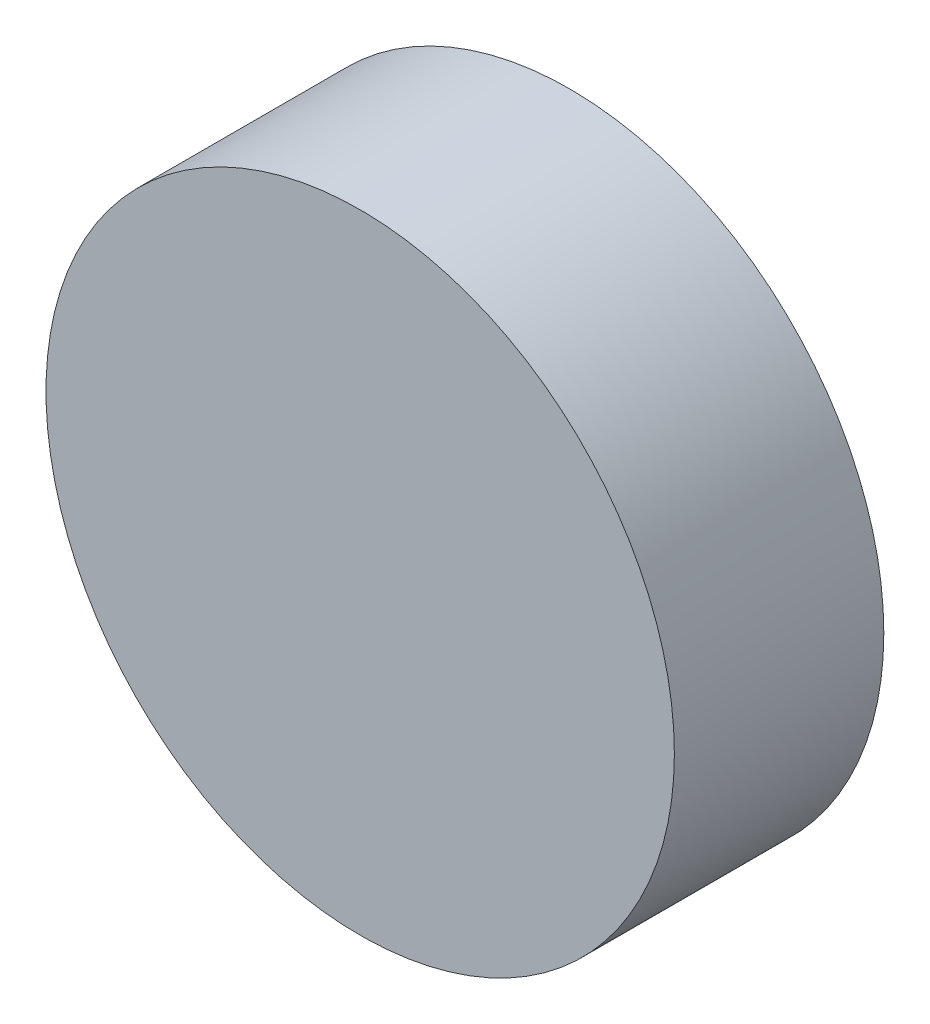
ISO-10303-21;
HEADER;
FILE_DESCRIPTION(('STEP AP214'),'2;1');
FILE_NAME('part.step','',(''),(''),'','','');
FILE_SCHEMA(('AUTOMOTIVE_DESIGN { 1 0 10303 214 1 1 1 1 }'));
ENDSEC;
DATA;
#1=APPLICATION_CONTEXT('core data for automotive mechanical design processes');
#2=APPLICATION_PROTOCOL_DEFINITION('international standard','automotive_design',2000,#1);
#3=PRODUCT_CONTEXT('',#1,'mechanical');
#4=PRODUCT('Part','Part','',(#3));
#5=PRODUCT_RELATED_PRODUCT_CATEGORY('part','',(#4));
#6=PRODUCT_DEFINITION_FORMATION('','',#4);
#7=PRODUCT_DEFINITION_CONTEXT('part definition',#1,'design');
#8=PRODUCT_DEFINITION('design','',#6,#7);
#9=PRODUCT_DEFINITION_SHAPE('','',#8);
#10=(LENGTH_UNIT() NAMED_UNIT(*) SI_UNIT(.MILLI.,.METRE.));
#11=(NAMED_UNIT(*) PLANE_ANGLE_UNIT() SI_UNIT($,.RADIAN.));
#12=(NAMED_UNIT(*) SI_UNIT($,.STERADIAN.) SOLID_ANGLE_UNIT());
#13=UNCERTAINTY_MEASURE_WITH_UNIT(LENGTH_MEASURE(1.E-05),#10,'distance_accuracy_value','');
#14=(GEOMETRIC_REPRESENTATION_CONTEXT(3) GLOBAL_UNCERTAINTY_ASSIGNED_CONTEXT((#13)) GLOBAL_UNIT_ASSIGNED_CONTEXT((#10,
#11,#12)) REPRESENTATION_CONTEXT('',''));
#15=CARTESIAN_POINT('',(0.,0.,0.));
#16=DIRECTION('',(0.,0.,1.));
#17=DIRECTION('',(1.,0.,0.));
#18=AXIS2_PLACEMENT_3D('',#15,#16,#17);
#19=CARTESIAN_POINT('',(0.,0.,40.));
#20=DIRECTION('',(0.,0.,-1.));
#21=DIRECTION('',(-1.,0.,0.));
#22=AXIS2_PLACEMENT_3D('',#19,#20,#21);
#23=CYLINDRICAL_SURFACE('',#22,60.);
#24=CARTESIAN_POINT('',(0.,0.,40.));
#25=DIRECTION('',(0.,0.,1.));
#26=DIRECTION('',(1.,0.,0.));
#27=AXIS2_PLACEMENT_3D('',#24,#25,#26);
#28=CIRCLE('',#27,60.);
#29=CARTESIAN_POINT('',(60.,0.,40.));
#30=VERTEX_POINT('',#29);
#31=EDGE_CURVE('E10',#30,#30,#28,.T.);
#32=ORIENTED_EDGE('',*,*,#31,.F.);
#33=EDGE_LOOP('',(#32));
#34=FACE_BOUND('',#33,.T.);
#35=CARTESIAN_POINT('',(0.,0.,0.));
#36=DIRECTION('',(0.,0.,1.));
#37=DIRECTION('',(1.,0.,0.));
#38=AXIS2_PLACEMENT_3D('',#35,#36,#37);
#39=CIRCLE('',#38,60.);
#40=CARTESIAN_POINT('',(60.,0.,0.));
#41=VERTEX_POINT('',#40);
#42=EDGE_CURVE('E42',#41,#41,#39,.T.);
#43=ORIENTED_EDGE('',*,*,#42,.T.);
#44=EDGE_LOOP('',(#43));
#45=FACE_BOUND('',#44,.T.);
#46=ADVANCED_FACE('F39',(#34,#45),#23,.T.);
#47=CARTESIAN_POINT('',(0.,0.,40.));
#48=DIRECTION('',(0.,0.,1.));
#49=DIRECTION('',(1.,0.,0.));
#50=AXIS2_PLACEMENT_3D('',#47,#48,#49);
#51=PLANE('',#50);
#52=ORIENTED_EDGE('',*,*,#31,.T.);
#53=EDGE_LOOP('',(#52));
#54=FACE_BOUND('',#53,.T.);
#55=ADVANCED_FACE('F54',(#54),#51,.T.);
#56=CARTESIAN_POINT('',(0.,0.,0.));
#57=DIRECTION('',(0.,0.,1.));
#58=DIRECTION('',(1.,0.,0.));
#59=AXIS2_PLACEMENT_3D('',#56,#57,#58);
#60=PLANE('',#59);
#61=ORIENTED_EDGE('',*,*,#42,.F.);
#62=EDGE_LOOP('',(#61));
#63=FACE_BOUND('',#62,.T.);
#64=ADVANCED_FACE('F52',(#63),#60,.F.);
#65=CLOSED_SHELL('',(#46,#55,#64));
#66=MANIFOLD_SOLID_BREP('B2',#65);
#67=ADVANCED_BREP_SHAPE_REPRESENTATION('',(#18,#66),#14);
#68=SHAPE_DEFINITION_REPRESENTATION(#9,#67);
ENDSEC;
END-ISO-10303-21;
